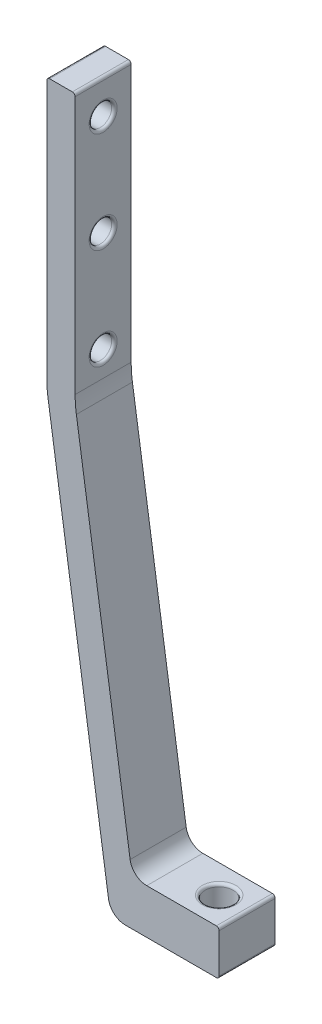
ISO-10303-21;
HEADER;
FILE_DESCRIPTION(('STEP AP214'),'2;1');
FILE_NAME('part.step','',(''),(''),'','','');
FILE_SCHEMA(('AUTOMOTIVE_DESIGN { 1 0 10303 214 1 1 1 1 }'));
ENDSEC;
DATA;
#1=APPLICATION_CONTEXT('core data for automotive mechanical design processes');
#2=APPLICATION_PROTOCOL_DEFINITION('international standard','automotive_design',2000,#1);
#3=PRODUCT_CONTEXT('',#1,'mechanical');
#4=PRODUCT('Part','Part','',(#3));
#5=PRODUCT_RELATED_PRODUCT_CATEGORY('part','',(#4));
#6=PRODUCT_DEFINITION_FORMATION('','',#4);
#7=PRODUCT_DEFINITION_CONTEXT('part definition',#1,'design');
#8=PRODUCT_DEFINITION('design','',#6,#7);
#9=PRODUCT_DEFINITION_SHAPE('','',#8);
#10=(LENGTH_UNIT() NAMED_UNIT(*) SI_UNIT(.MILLI.,.METRE.));
#11=(NAMED_UNIT(*) PLANE_ANGLE_UNIT() SI_UNIT($,.RADIAN.));
#12=(NAMED_UNIT(*) SI_UNIT($,.STERADIAN.) SOLID_ANGLE_UNIT());
#13=UNCERTAINTY_MEASURE_WITH_UNIT(LENGTH_MEASURE(1.E-05),#10,'distance_accuracy_value','');
#14=(GEOMETRIC_REPRESENTATION_CONTEXT(3) GLOBAL_UNCERTAINTY_ASSIGNED_CONTEXT((#13)) GLOBAL_UNIT_ASSIGNED_CONTEXT((#10,
#11,#12)) REPRESENTATION_CONTEXT('',''));
#15=CARTESIAN_POINT('',(0.,0.,0.));
#16=DIRECTION('',(0.,0.,1.));
#17=DIRECTION('',(1.,0.,0.));
#18=AXIS2_PLACEMENT_3D('',#15,#16,#17);
#19=CARTESIAN_POINT('',(-27.,8.,5.));
#20=DIRECTION('',(-1.,0.,0.));
#21=DIRECTION('',(0.,0.,1.));
#22=AXIS2_PLACEMENT_3D('',#19,#20,#21);
#23=PLANE('',#22);
#24=DIRECTION('',(0.,1.,0.));
#25=VECTOR('',#24,1.);
#26=CARTESIAN_POINT('',(-27.,8.,5.));
#27=LINE('',#26,#25);
#28=CARTESIAN_POINT('',(-27.,0.5,5.));
#29=VERTEX_POINT('',#28);
#30=CARTESIAN_POINT('',(-27.,7.5,5.));
#31=VERTEX_POINT('',#30);
#32=EDGE_CURVE('E171',#29,#31,#27,.T.);
#33=ORIENTED_EDGE('',*,*,#32,.F.);
#34=DIRECTION('',(0.,0.,-1.));
#35=VECTOR('',#34,1.);
#36=CARTESIAN_POINT('',(-27.,0.5,5.));
#37=LINE('',#36,#35);
#38=CARTESIAN_POINT('',(-27.,0.5,-5.));
#39=VERTEX_POINT('',#38);
#40=EDGE_CURVE('E256',#29,#39,#37,.T.);
#41=ORIENTED_EDGE('',*,*,#40,.T.);
#42=DIRECTION('',(0.,1.,0.));
#43=VECTOR('',#42,1.);
#44=CARTESIAN_POINT('',(-27.,8.,-5.));
#45=LINE('',#44,#43);
#46=CARTESIAN_POINT('',(-27.,7.5,-5.));
#47=VERTEX_POINT('',#46);
#48=EDGE_CURVE('E321',#39,#47,#45,.T.);
#49=ORIENTED_EDGE('',*,*,#48,.T.);
#50=DIRECTION('',(0.,0.,-1.));
#51=VECTOR('',#50,1.);
#52=CARTESIAN_POINT('',(-27.,7.5,5.));
#53=LINE('',#52,#51);
#54=EDGE_CURVE('E254',#47,#31,#53,.F.);
#55=ORIENTED_EDGE('',*,*,#54,.T.);
#56=EDGE_LOOP('',(#33,#41,#49,#55));
#57=FACE_BOUND('',#56,.T.);
#58=ADVANCED_FACE('F34',(#57),#23,.F.);
#59=CARTESIAN_POINT('',(-42.5,8.,5.));
#60=DIRECTION('',(0.,-1.,0.));
#61=DIRECTION('',(0.,0.,-1.));
#62=AXIS2_PLACEMENT_3D('',#59,#60,#61);
#63=PLANE('',#62);
#64=CARTESIAN_POINT('',(-32.,8.,0.));
#65=DIRECTION('',(0.,-1.,0.));
#66=DIRECTION('',(0.,0.,-1.));
#67=AXIS2_PLACEMENT_3D('',#64,#65,#66);
#68=CIRCLE('',#67,3.);
#69=CARTESIAN_POINT('',(-32.,8.,-3.));
#70=VERTEX_POINT('',#69);
#71=EDGE_CURVE('E251',#70,#70,#68,.T.);
#72=ORIENTED_EDGE('',*,*,#71,.T.);
#73=EDGE_LOOP('',(#72));
#74=FACE_BOUND('',#73,.T.);
#75=DIRECTION('',(-1.,0.,0.));
#76=VECTOR('',#75,1.);
#77=CARTESIAN_POINT('',(-42.5,8.,5.));
#78=LINE('',#77,#76);
#79=CARTESIAN_POINT('',(-27.5,8.,5.));
#80=VERTEX_POINT('',#79);
#81=CARTESIAN_POINT('',(-39.9162170569194,8.,5.));
#82=VERTEX_POINT('',#81);
#83=EDGE_CURVE('E175',#80,#82,#78,.T.);
#84=ORIENTED_EDGE('',*,*,#83,.F.);
#85=DIRECTION('',(0.,0.,-1.));
#86=VECTOR('',#85,1.);
#87=CARTESIAN_POINT('',(-27.5,8.,5.));
#88=LINE('',#87,#86);
#89=CARTESIAN_POINT('',(-27.5,8.,-5.));
#90=VERTEX_POINT('',#89);
#91=EDGE_CURVE('E248',#80,#90,#88,.T.);
#92=ORIENTED_EDGE('',*,*,#91,.T.);
#93=DIRECTION('',(-1.,0.,0.));
#94=VECTOR('',#93,1.);
#95=CARTESIAN_POINT('',(-42.5,8.,-5.));
#96=LINE('',#95,#94);
#97=CARTESIAN_POINT('',(-39.9162170569194,8.,-5.));
#98=VERTEX_POINT('',#97);
#99=EDGE_CURVE('E300',#90,#98,#96,.T.);
#100=ORIENTED_EDGE('',*,*,#99,.T.);
#101=DIRECTION('',(0.,0.,-1.));
#102=VECTOR('',#101,1.);
#103=CARTESIAN_POINT('',(-39.9162170569194,8.,5.));
#104=LINE('',#103,#102);
#105=EDGE_CURVE('E187',#98,#82,#104,.F.);
#106=ORIENTED_EDGE('',*,*,#105,.T.);
#107=EDGE_LOOP('',(#84,#92,#100,#106));
#108=FACE_BOUND('',#107,.T.);
#109=ADVANCED_FACE('F357',(#74,#108),#63,.F.);
#110=CARTESIAN_POINT('',(-52.6941269376831,76.,5.));
#111=DIRECTION('',(-0.988948879525204,-0.148256917834696,0.));
#112=DIRECTION('',(0.148256917834696,-0.988948879525204,0.));
#113=AXIS2_PLACEMENT_3D('',#110,#111,#112);
#114=PLANE('',#113);
#115=DIRECTION('',(-0.148256917834696,0.988948879525204,0.));
#116=VECTOR('',#115,1.);
#117=CARTESIAN_POINT('',(-52.6941269376831,76.,-5.));
#118=LINE('',#117,#116);
#119=CARTESIAN_POINT('',(-42.883063695495,10.5552292464959,-5.));
#120=VERTEX_POINT('',#119);
#121=CARTESIAN_POINT('',(-52.4731045281871,74.5256683639905,-5.));
#122=VERTEX_POINT('',#121);
#123=EDGE_CURVE('E294',#120,#122,#118,.T.);
#124=ORIENTED_EDGE('',*,*,#123,.T.);
#125=DIRECTION('',(0.,0.,-1.));
#126=VECTOR('',#125,1.);
#127=CARTESIAN_POINT('',(-52.4731045281871,74.5256683639905,5.));
#128=LINE('',#127,#126);
#129=CARTESIAN_POINT('',(-52.4731045281871,74.5256683639905,5.));
#130=VERTEX_POINT('',#129);
#131=EDGE_CURVE('E55',#122,#130,#128,.F.);
#132=ORIENTED_EDGE('',*,*,#131,.T.);
#133=DIRECTION('',(-0.148256917834696,0.988948879525204,0.));
#134=VECTOR('',#133,1.);
#135=CARTESIAN_POINT('',(-52.6941269376831,76.,5.));
#136=LINE('',#135,#134);
#137=CARTESIAN_POINT('',(-42.883063695495,10.5552292464959,5.));
#138=VERTEX_POINT('',#137);
#139=EDGE_CURVE('E308',#138,#130,#136,.T.);
#140=ORIENTED_EDGE('',*,*,#139,.F.);
#141=DIRECTION('',(0.,0.,-1.));
#142=VECTOR('',#141,1.);
#143=CARTESIAN_POINT('',(-42.883063695495,10.5552292464959,-5.));
#144=LINE('',#143,#142);
#145=EDGE_CURVE('E184',#138,#120,#144,.T.);
#146=ORIENTED_EDGE('',*,*,#145,.T.);
#147=EDGE_LOOP('',(#124,#132,#140,#146));
#148=FACE_BOUND('',#147,.T.);
#149=ADVANCED_FACE('F298',(#148),#114,.F.);
#150=CARTESIAN_POINT('',(-52.6941269376831,76.,5.));
#151=DIRECTION('',(-1.,0.,0.));
#152=DIRECTION('',(0.,0.,1.));
#153=AXIS2_PLACEMENT_3D('',#150,#151,#152);
#154=PLANE('',#153);
#155=CARTESIAN_POINT('',(-52.6941269376831,118.,0.));
#156=DIRECTION('',(-1.,0.,0.));
#157=DIRECTION('',(0.,0.,1.));
#158=AXIS2_PLACEMENT_3D('',#155,#156,#157);
#159=CIRCLE('',#158,2.5);
#160=CARTESIAN_POINT('',(-52.6941269376831,118.,2.5));
#161=VERTEX_POINT('',#160);
#162=EDGE_CURVE('E222',#161,#161,#159,.T.);
#163=ORIENTED_EDGE('',*,*,#162,.T.);
#164=EDGE_LOOP('',(#163));
#165=FACE_BOUND('',#164,.T.);
#166=CARTESIAN_POINT('',(-52.6941269376831,82.,0.));
#167=DIRECTION('',(-1.,0.,0.));
#168=DIRECTION('',(0.,0.,1.));
#169=AXIS2_PLACEMENT_3D('',#166,#167,#168);
#170=CIRCLE('',#169,2.5);
#171=CARTESIAN_POINT('',(-52.6941269376831,82.,2.5));
#172=VERTEX_POINT('',#171);
#173=EDGE_CURVE('E219',#172,#172,#170,.T.);
#174=ORIENTED_EDGE('',*,*,#173,.T.);
#175=EDGE_LOOP('',(#174));
#176=FACE_BOUND('',#175,.T.);
#177=CARTESIAN_POINT('',(-52.6941269376831,100.,0.));
#178=DIRECTION('',(-1.,0.,0.));
#179=DIRECTION('',(0.,0.,1.));
#180=AXIS2_PLACEMENT_3D('',#177,#178,#179);
#181=CIRCLE('',#180,2.5);
#182=CARTESIAN_POINT('',(-52.6941269376831,100.,2.5));
#183=VERTEX_POINT('',#182);
#184=EDGE_CURVE('E216',#183,#183,#181,.T.);
#185=ORIENTED_EDGE('',*,*,#184,.T.);
#186=EDGE_LOOP('',(#185));
#187=FACE_BOUND('',#186,.T.);
#188=DIRECTION('',(0.,1.,0.));
#189=VECTOR('',#188,1.);
#190=CARTESIAN_POINT('',(-52.6941269376831,76.,5.));
#191=LINE('',#190,#189);
#192=CARTESIAN_POINT('',(-52.6941269376831,77.4908067206844,5.));
#193=VERTEX_POINT('',#192);
#194=CARTESIAN_POINT('',(-52.6941269376831,123.5,5.));
#195=VERTEX_POINT('',#194);
#196=EDGE_CURVE('E304',#193,#195,#191,.T.);
#197=ORIENTED_EDGE('',*,*,#196,.F.);
#198=DIRECTION('',(0.,0.,-1.));
#199=VECTOR('',#198,1.);
#200=CARTESIAN_POINT('',(-52.6941269376831,77.4908067206844,-5.));
#201=LINE('',#200,#199);
#202=CARTESIAN_POINT('',(-52.6941269376831,77.4908067206844,-5.));
#203=VERTEX_POINT('',#202);
#204=EDGE_CURVE('E289',#193,#203,#201,.T.);
#205=ORIENTED_EDGE('',*,*,#204,.T.);
#206=DIRECTION('',(0.,1.,0.));
#207=VECTOR('',#206,1.);
#208=CARTESIAN_POINT('',(-52.6941269376831,76.,-5.));
#209=LINE('',#208,#207);
#210=CARTESIAN_POINT('',(-52.6941269376831,123.5,-5.));
#211=VERTEX_POINT('',#210);
#212=EDGE_CURVE('E295',#203,#211,#209,.T.);
#213=ORIENTED_EDGE('',*,*,#212,.T.);
#214=DIRECTION('',(0.,0.,-1.));
#215=VECTOR('',#214,1.);
#216=CARTESIAN_POINT('',(-52.6941269376831,123.5,5.));
#217=LINE('',#216,#215);
#218=EDGE_CURVE('E213',#211,#195,#217,.F.);
#219=ORIENTED_EDGE('',*,*,#218,.T.);
#220=EDGE_LOOP('',(#197,#205,#213,#219));
#221=FACE_BOUND('',#220,.T.);
#222=ADVANCED_FACE('F303',(#165,#176,#187,#221),#154,.F.);
#223=CARTESIAN_POINT('',(-57.75,124.,5.));
#224=DIRECTION('',(0.,-1.,0.));
#225=DIRECTION('',(0.,0.,-1.));
#226=AXIS2_PLACEMENT_3D('',#223,#224,#225);
#227=PLANE('',#226);
#228=DIRECTION('',(-1.,0.,0.));
#229=VECTOR('',#228,1.);
#230=CARTESIAN_POINT('',(-57.75,124.,5.));
#231=LINE('',#230,#229);
#232=CARTESIAN_POINT('',(-53.1941269376831,124.,5.));
#233=VERTEX_POINT('',#232);
#234=CARTESIAN_POINT('',(-57.25,124.,5.));
#235=VERTEX_POINT('',#234);
#236=EDGE_CURVE('E307',#233,#235,#231,.T.);
#237=ORIENTED_EDGE('',*,*,#236,.F.);
#238=DIRECTION('',(0.,0.,-1.));
#239=VECTOR('',#238,1.);
#240=CARTESIAN_POINT('',(-53.1941269376831,124.,5.));
#241=LINE('',#240,#239);
#242=CARTESIAN_POINT('',(-53.1941269376831,124.,-5.));
#243=VERTEX_POINT('',#242);
#244=EDGE_CURVE('E277',#233,#243,#241,.T.);
#245=ORIENTED_EDGE('',*,*,#244,.T.);
#246=DIRECTION('',(-1.,0.,0.));
#247=VECTOR('',#246,1.);
#248=CARTESIAN_POINT('',(-57.75,124.,-5.));
#249=LINE('',#248,#247);
#250=CARTESIAN_POINT('',(-57.25,124.,-5.));
#251=VERTEX_POINT('',#250);
#252=EDGE_CURVE('E326',#243,#251,#249,.T.);
#253=ORIENTED_EDGE('',*,*,#252,.T.);
#254=DIRECTION('',(0.,0.,-1.));
#255=VECTOR('',#254,1.);
#256=CARTESIAN_POINT('',(-57.25,124.,5.));
#257=LINE('',#256,#255);
#258=EDGE_CURVE('E275',#251,#235,#257,.F.);
#259=ORIENTED_EDGE('',*,*,#258,.T.);
#260=EDGE_LOOP('',(#237,#245,#253,#259));
#261=FACE_BOUND('',#260,.T.);
#262=ADVANCED_FACE('F386',(#261),#227,.F.);
#263=CARTESIAN_POINT('',(-57.75,76.,5.));
#264=DIRECTION('',(1.,0.,0.));
#265=DIRECTION('',(0.,0.,-1.));
#266=AXIS2_PLACEMENT_3D('',#263,#264,#265);
#267=PLANE('',#266);
#268=CARTESIAN_POINT('',(-57.75,118.,0.));
#269=DIRECTION('',(1.,0.,0.));
#270=DIRECTION('',(0.,0.,-1.));
#271=AXIS2_PLACEMENT_3D('',#268,#269,#270);
#272=CIRCLE('',#271,2.5);
#273=CARTESIAN_POINT('',(-57.75,118.,-2.5));
#274=VERTEX_POINT('',#273);
#275=EDGE_CURVE('E210',#274,#274,#272,.T.);
#276=ORIENTED_EDGE('',*,*,#275,.T.);
#277=EDGE_LOOP('',(#276));
#278=FACE_BOUND('',#277,.T.);
#279=CARTESIAN_POINT('',(-57.75,82.,0.));
#280=DIRECTION('',(1.,0.,0.));
#281=DIRECTION('',(0.,0.,-1.));
#282=AXIS2_PLACEMENT_3D('',#279,#280,#281);
#283=CIRCLE('',#282,2.5);
#284=CARTESIAN_POINT('',(-57.75,82.,-2.5));
#285=VERTEX_POINT('',#284);
#286=EDGE_CURVE('E207',#285,#285,#283,.T.);
#287=ORIENTED_EDGE('',*,*,#286,.T.);
#288=EDGE_LOOP('',(#287));
#289=FACE_BOUND('',#288,.T.);
#290=CARTESIAN_POINT('',(-57.75,100.,0.));
#291=DIRECTION('',(1.,0.,0.));
#292=DIRECTION('',(0.,0.,-1.));
#293=AXIS2_PLACEMENT_3D('',#290,#291,#292);
#294=CIRCLE('',#293,2.5);
#295=CARTESIAN_POINT('',(-57.75,100.,-2.5));
#296=VERTEX_POINT('',#295);
#297=EDGE_CURVE('E204',#296,#296,#294,.T.);
#298=ORIENTED_EDGE('',*,*,#297,.T.);
#299=EDGE_LOOP('',(#298));
#300=FACE_BOUND('',#299,.T.);
#301=DIRECTION('',(0.,-1.,0.));
#302=VECTOR('',#301,1.);
#303=CARTESIAN_POINT('',(-57.75,76.,-5.));
#304=LINE('',#303,#302);
#305=CARTESIAN_POINT('',(-57.75,123.5,-5.));
#306=VERTEX_POINT('',#305);
#307=CARTESIAN_POINT('',(-57.75,77.4908067206844,-5.));
#308=VERTEX_POINT('',#307);
#309=EDGE_CURVE('E177',#306,#308,#304,.T.);
#310=ORIENTED_EDGE('',*,*,#309,.T.);
#311=DIRECTION('',(0.,0.,-1.));
#312=VECTOR('',#311,1.);
#313=CARTESIAN_POINT('',(-57.75,77.4908067206844,5.));
#314=LINE('',#313,#312);
#315=CARTESIAN_POINT('',(-57.75,77.4908067206844,5.));
#316=VERTEX_POINT('',#315);
#317=EDGE_CURVE('E285',#308,#316,#314,.F.);
#318=ORIENTED_EDGE('',*,*,#317,.T.);
#319=DIRECTION('',(0.,-1.,0.));
#320=VECTOR('',#319,1.);
#321=CARTESIAN_POINT('',(-57.75,76.,5.));
#322=LINE('',#321,#320);
#323=CARTESIAN_POINT('',(-57.75,123.5,5.));
#324=VERTEX_POINT('',#323);
#325=EDGE_CURVE('E311',#324,#316,#322,.T.);
#326=ORIENTED_EDGE('',*,*,#325,.F.);
#327=DIRECTION('',(0.,0.,-1.));
#328=VECTOR('',#327,1.);
#329=CARTESIAN_POINT('',(-57.75,123.5,5.));
#330=LINE('',#329,#328);
#331=EDGE_CURVE('E201',#324,#306,#330,.T.);
#332=ORIENTED_EDGE('',*,*,#331,.T.);
#333=EDGE_LOOP('',(#310,#318,#326,#332));
#334=FACE_BOUND('',#333,.T.);
#335=ADVANCED_FACE('F332',(#278,#289,#300,#334),#267,.F.);
#336=CARTESIAN_POINT('',(-46.3565640108248,0.,5.));
#337=DIRECTION('',(0.988948879525204,0.148256917834696,0.));
#338=DIRECTION('',(-0.148256917834696,0.988948879525204,0.));
#339=AXIS2_PLACEMENT_3D('',#336,#337,#338);
#340=PLANE('',#339);
#341=DIRECTION('',(0.148256917834696,-0.988948879525204,0.));
#342=VECTOR('',#341,1.);
#343=CARTESIAN_POINT('',(-46.3565640108248,0.,5.));
#344=LINE('',#343,#342);
#345=CARTESIAN_POINT('',(-57.5289775905041,74.5256683639905,5.));
#346=VERTEX_POINT('',#345);
#347=CARTESIAN_POINT('',(-46.7396277063198,2.55522924649591,5.));
#348=VERTEX_POINT('',#347);
#349=EDGE_CURVE('E318',#346,#348,#344,.T.);
#350=ORIENTED_EDGE('',*,*,#349,.F.);
#351=DIRECTION('',(0.,0.,-1.));
#352=VECTOR('',#351,1.);
#353=CARTESIAN_POINT('',(-57.5289775905041,74.5256683639905,5.));
#354=LINE('',#353,#352);
#355=CARTESIAN_POINT('',(-57.5289775905041,74.5256683639905,-5.));
#356=VERTEX_POINT('',#355);
#357=EDGE_CURVE('E280',#346,#356,#354,.T.);
#358=ORIENTED_EDGE('',*,*,#357,.T.);
#359=DIRECTION('',(0.148256917834696,-0.988948879525204,0.));
#360=VECTOR('',#359,1.);
#361=CARTESIAN_POINT('',(-46.3565640108248,0.,-5.));
#362=LINE('',#361,#360);
#363=CARTESIAN_POINT('',(-46.7396277063198,2.55522924649591,-5.));
#364=VERTEX_POINT('',#363);
#365=EDGE_CURVE('E172',#356,#364,#362,.T.);
#366=ORIENTED_EDGE('',*,*,#365,.T.);
#367=DIRECTION('',(0.,0.,-1.));
#368=VECTOR('',#367,1.);
#369=CARTESIAN_POINT('',(-46.7396277063198,2.55522924649591,5.));
#370=LINE('',#369,#368);
#371=EDGE_CURVE('E154',#364,#348,#370,.F.);
#372=ORIENTED_EDGE('',*,*,#371,.T.);
#373=EDGE_LOOP('',(#350,#358,#366,#372));
#374=FACE_BOUND('',#373,.T.);
#375=ADVANCED_FACE('F342',(#374),#340,.F.);
#376=CARTESIAN_POINT('',(-27.,0.,5.));
#377=DIRECTION('',(0.,1.,0.));
#378=DIRECTION('',(-1.,0.,0.));
#379=AXIS2_PLACEMENT_3D('',#376,#377,#378);
#380=PLANE('',#379);
#381=CARTESIAN_POINT('',(-32.,0.,0.));
#382=DIRECTION('',(0.,1.,0.));
#383=DIRECTION('',(-1.,0.,0.));
#384=AXIS2_PLACEMENT_3D('',#381,#382,#383);
#385=CIRCLE('',#384,3.);
#386=CARTESIAN_POINT('',(-35.,0.,0.));
#387=VERTEX_POINT('',#386);
#388=EDGE_CURVE('E239',#387,#387,#385,.T.);
#389=ORIENTED_EDGE('',*,*,#388,.T.);
#390=EDGE_LOOP('',(#389));
#391=FACE_BOUND('',#390,.T.);
#392=DIRECTION('',(1.,0.,0.));
#393=VECTOR('',#392,1.);
#394=CARTESIAN_POINT('',(-27.,0.,-5.));
#395=LINE('',#394,#393);
#396=CARTESIAN_POINT('',(-43.7727810677442,0.,-5.));
#397=VERTEX_POINT('',#396);
#398=CARTESIAN_POINT('',(-27.5,0.,-5.));
#399=VERTEX_POINT('',#398);
#400=EDGE_CURVE('E163',#397,#399,#395,.T.);
#401=ORIENTED_EDGE('',*,*,#400,.T.);
#402=DIRECTION('',(0.,0.,-1.));
#403=VECTOR('',#402,1.);
#404=CARTESIAN_POINT('',(-27.5,0.,5.));
#405=LINE('',#404,#403);
#406=CARTESIAN_POINT('',(-27.5,0.,5.));
#407=VERTEX_POINT('',#406);
#408=EDGE_CURVE('E237',#399,#407,#405,.F.);
#409=ORIENTED_EDGE('',*,*,#408,.T.);
#410=DIRECTION('',(1.,0.,0.));
#411=VECTOR('',#410,1.);
#412=CARTESIAN_POINT('',(-27.,0.,5.));
#413=LINE('',#412,#411);
#414=CARTESIAN_POINT('',(-43.7727810677442,0.,5.));
#415=VERTEX_POINT('',#414);
#416=EDGE_CURVE('E166',#415,#407,#413,.T.);
#417=ORIENTED_EDGE('',*,*,#416,.F.);
#418=DIRECTION('',(0.,0.,-1.));
#419=VECTOR('',#418,1.);
#420=CARTESIAN_POINT('',(-43.7727810677442,0.,5.));
#421=LINE('',#420,#419);
#422=EDGE_CURVE('E152',#415,#397,#421,.T.);
#423=ORIENTED_EDGE('',*,*,#422,.T.);
#424=EDGE_LOOP('',(#401,#409,#417,#423));
#425=FACE_BOUND('',#424,.T.);
#426=ADVANCED_FACE('F162',(#391,#425),#380,.F.);
#427=CARTESIAN_POINT('',(0.,0.,5.));
#428=DIRECTION('',(0.,0.,-1.));
#429=DIRECTION('',(-1.,0.,0.));
#430=AXIS2_PLACEMENT_3D('',#427,#428,#429);
#431=PLANE('',#430);
#432=ORIENTED_EDGE('',*,*,#325,.T.);
#433=CARTESIAN_POINT('',(-37.75,77.4908067206844,5.));
#434=DIRECTION('',(0.,0.,-1.));
#435=DIRECTION('',(-1.,0.,0.));
#436=AXIS2_PLACEMENT_3D('',#433,#434,#435);
#437=CIRCLE('',#436,20.);
#438=EDGE_CURVE('E287',#316,#346,#437,.F.);
#439=ORIENTED_EDGE('',*,*,#438,.T.);
#440=ORIENTED_EDGE('',*,*,#349,.T.);
#441=CARTESIAN_POINT('',(-43.7727810677442,3.,5.));
#442=DIRECTION('',(0.,0.,-1.));
#443=DIRECTION('',(-1.,0.,0.));
#444=AXIS2_PLACEMENT_3D('',#441,#442,#443);
#445=CIRCLE('',#444,3.);
#446=EDGE_CURVE('E182',#348,#415,#445,.F.);
#447=ORIENTED_EDGE('',*,*,#446,.T.);
#448=ORIENTED_EDGE('',*,*,#416,.T.);
#449=CARTESIAN_POINT('',(-27.5,0.5,5.));
#450=DIRECTION('',(0.,0.,-1.));
#451=DIRECTION('',(-1.,0.,0.));
#452=AXIS2_PLACEMENT_3D('',#449,#450,#451);
#453=CIRCLE('',#452,0.5);
#454=EDGE_CURVE('E273',#407,#29,#453,.F.);
#455=ORIENTED_EDGE('',*,*,#454,.T.);
#456=ORIENTED_EDGE('',*,*,#32,.T.);
#457=CARTESIAN_POINT('',(-27.5,7.5,5.));
#458=DIRECTION('',(0.,0.,-1.));
#459=DIRECTION('',(-1.,0.,0.));
#460=AXIS2_PLACEMENT_3D('',#457,#458,#459);
#461=CIRCLE('',#460,0.5);
#462=EDGE_CURVE('E271',#31,#80,#461,.F.);
#463=ORIENTED_EDGE('',*,*,#462,.T.);
#464=ORIENTED_EDGE('',*,*,#83,.T.);
#465=CARTESIAN_POINT('',(-39.9162170569194,11.,5.));
#466=DIRECTION('',(0.,0.,-1.));
#467=DIRECTION('',(-1.,0.,0.));
#468=AXIS2_PLACEMENT_3D('',#465,#466,#467);
#469=CIRCLE('',#468,3.);
#470=EDGE_CURVE('E193',#82,#138,#469,.T.);
#471=ORIENTED_EDGE('',*,*,#470,.T.);
#472=ORIENTED_EDGE('',*,*,#139,.T.);
#473=CARTESIAN_POINT('',(-32.6941269376831,77.4908067206844,5.));
#474=DIRECTION('',(0.,0.,-1.));
#475=DIRECTION('',(-1.,0.,0.));
#476=AXIS2_PLACEMENT_3D('',#473,#474,#475);
#477=CIRCLE('',#476,20.);
#478=EDGE_CURVE('E11',#130,#193,#477,.T.);
#479=ORIENTED_EDGE('',*,*,#478,.T.);
#480=ORIENTED_EDGE('',*,*,#196,.T.);
#481=CARTESIAN_POINT('',(-53.1941269376831,123.5,5.));
#482=DIRECTION('',(0.,0.,-1.));
#483=DIRECTION('',(-1.,0.,0.));
#484=AXIS2_PLACEMENT_3D('',#481,#482,#483);
#485=CIRCLE('',#484,0.5);
#486=EDGE_CURVE('E269',#195,#233,#485,.F.);
#487=ORIENTED_EDGE('',*,*,#486,.T.);
#488=ORIENTED_EDGE('',*,*,#236,.T.);
#489=CARTESIAN_POINT('',(-57.25,123.5,5.));
#490=DIRECTION('',(0.,0.,-1.));
#491=DIRECTION('',(-1.,0.,0.));
#492=AXIS2_PLACEMENT_3D('',#489,#490,#491);
#493=CIRCLE('',#492,0.5);
#494=EDGE_CURVE('E267',#235,#324,#493,.F.);
#495=ORIENTED_EDGE('',*,*,#494,.T.);
#496=EDGE_LOOP('',(#432,#439,#440,#447,#448,#455,#456,#463,#464,#471,#472,#479,#480,#487,#488,#495));
#497=FACE_BOUND('',#496,.T.);
#498=ADVANCED_FACE('F340',(#497),#431,.F.);
#499=CARTESIAN_POINT('',(0.,0.,-5.));
#500=DIRECTION('',(0.,0.,-1.));
#501=DIRECTION('',(-1.,0.,0.));
#502=AXIS2_PLACEMENT_3D('',#499,#500,#501);
#503=PLANE('',#502);
#504=ORIENTED_EDGE('',*,*,#365,.F.);
#505=CARTESIAN_POINT('',(-37.75,77.4908067206844,-5.));
#506=DIRECTION('',(0.,0.,-1.));
#507=DIRECTION('',(-1.,0.,0.));
#508=AXIS2_PLACEMENT_3D('',#505,#506,#507);
#509=CIRCLE('',#508,20.);
#510=EDGE_CURVE('E283',#356,#308,#509,.T.);
#511=ORIENTED_EDGE('',*,*,#510,.T.);
#512=ORIENTED_EDGE('',*,*,#309,.F.);
#513=CARTESIAN_POINT('',(-57.25,123.5,-5.));
#514=DIRECTION('',(0.,0.,-1.));
#515=DIRECTION('',(-1.,0.,0.));
#516=AXIS2_PLACEMENT_3D('',#513,#514,#515);
#517=CIRCLE('',#516,0.5);
#518=EDGE_CURVE('E259',#306,#251,#517,.T.);
#519=ORIENTED_EDGE('',*,*,#518,.T.);
#520=ORIENTED_EDGE('',*,*,#252,.F.);
#521=CARTESIAN_POINT('',(-53.1941269376831,123.5,-5.));
#522=DIRECTION('',(0.,0.,-1.));
#523=DIRECTION('',(-1.,0.,0.));
#524=AXIS2_PLACEMENT_3D('',#521,#522,#523);
#525=CIRCLE('',#524,0.5);
#526=EDGE_CURVE('E261',#243,#211,#525,.T.);
#527=ORIENTED_EDGE('',*,*,#526,.T.);
#528=ORIENTED_EDGE('',*,*,#212,.F.);
#529=CARTESIAN_POINT('',(-32.6941269376831,77.4908067206844,-5.));
#530=DIRECTION('',(0.,0.,-1.));
#531=DIRECTION('',(-1.,0.,0.));
#532=AXIS2_PLACEMENT_3D('',#529,#530,#531);
#533=CIRCLE('',#532,20.);
#534=EDGE_CURVE('E42',#203,#122,#533,.F.);
#535=ORIENTED_EDGE('',*,*,#534,.T.);
#536=ORIENTED_EDGE('',*,*,#123,.F.);
#537=CARTESIAN_POINT('',(-39.9162170569194,11.,-5.));
#538=DIRECTION('',(0.,0.,-1.));
#539=DIRECTION('',(-1.,0.,0.));
#540=AXIS2_PLACEMENT_3D('',#537,#538,#539);
#541=CIRCLE('',#540,3.);
#542=EDGE_CURVE('E190',#120,#98,#541,.F.);
#543=ORIENTED_EDGE('',*,*,#542,.T.);
#544=ORIENTED_EDGE('',*,*,#99,.F.);
#545=CARTESIAN_POINT('',(-27.5,7.5,-5.));
#546=DIRECTION('',(0.,0.,-1.));
#547=DIRECTION('',(-1.,0.,0.));
#548=AXIS2_PLACEMENT_3D('',#545,#546,#547);
#549=CIRCLE('',#548,0.5);
#550=EDGE_CURVE('E264',#90,#47,#549,.T.);
#551=ORIENTED_EDGE('',*,*,#550,.T.);
#552=ORIENTED_EDGE('',*,*,#48,.F.);
#553=CARTESIAN_POINT('',(-27.5,0.5,-5.));
#554=DIRECTION('',(0.,0.,-1.));
#555=DIRECTION('',(-1.,0.,0.));
#556=AXIS2_PLACEMENT_3D('',#553,#554,#555);
#557=CIRCLE('',#556,0.5);
#558=EDGE_CURVE('E170',#39,#399,#557,.T.);
#559=ORIENTED_EDGE('',*,*,#558,.T.);
#560=ORIENTED_EDGE('',*,*,#400,.F.);
#561=CARTESIAN_POINT('',(-43.7727810677442,3.,-5.));
#562=DIRECTION('',(0.,0.,-1.));
#563=DIRECTION('',(-1.,0.,0.));
#564=AXIS2_PLACEMENT_3D('',#561,#562,#563);
#565=CIRCLE('',#564,3.);
#566=EDGE_CURVE('E148',#397,#364,#565,.T.);
#567=ORIENTED_EDGE('',*,*,#566,.T.);
#568=EDGE_LOOP('',(#504,#511,#512,#519,#520,#527,#528,#535,#536,#543,#544,#551,#552,#559,#560,#567));
#569=FACE_BOUND('',#568,.T.);
#570=ADVANCED_FACE('F168',(#569),#503,.T.);
#571=CARTESIAN_POINT('',(-32.,-2.,0.));
#572=DIRECTION('',(0.,1.,0.));
#573=DIRECTION('',(0.,0.,1.));
#574=AXIS2_PLACEMENT_3D('',#571,#572,#573);
#575=CYLINDRICAL_SURFACE('',#574,2.5);
#576=CARTESIAN_POINT('',(-32.,0.499999999999998,0.));
#577=DIRECTION('',(0.,1.,0.));
#578=DIRECTION('',(-1.,0.,0.));
#579=AXIS2_PLACEMENT_3D('',#576,#577,#578);
#580=CIRCLE('',#579,2.5);
#581=CARTESIAN_POINT('',(-34.5,0.499999999999998,0.));
#582=VERTEX_POINT('',#581);
#583=EDGE_CURVE('E245',#582,#582,#580,.F.);
#584=ORIENTED_EDGE('',*,*,#583,.T.);
#585=EDGE_LOOP('',(#584));
#586=FACE_BOUND('',#585,.T.);
#587=CARTESIAN_POINT('',(-32.,7.5,0.));
#588=DIRECTION('',(0.,-1.,0.));
#589=DIRECTION('',(0.,0.,-1.));
#590=AXIS2_PLACEMENT_3D('',#587,#588,#589);
#591=CIRCLE('',#590,2.5);
#592=CARTESIAN_POINT('',(-32.,7.5,-2.5));
#593=VERTEX_POINT('',#592);
#594=EDGE_CURVE('E242',#593,#593,#591,.F.);
#595=ORIENTED_EDGE('',*,*,#594,.T.);
#596=EDGE_LOOP('',(#595));
#597=FACE_BOUND('',#596,.T.);
#598=ADVANCED_FACE('F401',(#586,#597),#575,.F.);
#599=CARTESIAN_POINT('',(-57.751,100.,0.));
#600=DIRECTION('',(1.,0.,0.));
#601=DIRECTION('',(0.,0.,-1.));
#602=AXIS2_PLACEMENT_3D('',#599,#600,#601);
#603=CYLINDRICAL_SURFACE('',#602,2.);
#604=CARTESIAN_POINT('',(-57.25,100.,0.));
#605=DIRECTION('',(1.,0.,0.));
#606=DIRECTION('',(0.,0.,-1.));
#607=AXIS2_PLACEMENT_3D('',#604,#605,#606);
#608=CIRCLE('',#607,2.);
#609=CARTESIAN_POINT('',(-57.25,100.,-2.));
#610=VERTEX_POINT('',#609);
#611=EDGE_CURVE('E234',#610,#610,#608,.F.);
#612=ORIENTED_EDGE('',*,*,#611,.T.);
#613=EDGE_LOOP('',(#612));
#614=FACE_BOUND('',#613,.T.);
#615=CARTESIAN_POINT('',(-53.1941269376831,100.,0.));
#616=DIRECTION('',(-1.,0.,0.));
#617=DIRECTION('',(0.,0.,1.));
#618=AXIS2_PLACEMENT_3D('',#615,#616,#617);
#619=CIRCLE('',#618,2.);
#620=CARTESIAN_POINT('',(-53.1941269376831,100.,2.));
#621=VERTEX_POINT('',#620);
#622=EDGE_CURVE('E231',#621,#621,#619,.F.);
#623=ORIENTED_EDGE('',*,*,#622,.T.);
#624=EDGE_LOOP('',(#623));
#625=FACE_BOUND('',#624,.T.);
#626=ADVANCED_FACE('F406',(#614,#625),#603,.F.);
#627=CARTESIAN_POINT('',(-57.751,118.,0.));
#628=DIRECTION('',(1.,0.,0.));
#629=DIRECTION('',(0.,0.,-1.));
#630=AXIS2_PLACEMENT_3D('',#627,#628,#629);
#631=CYLINDRICAL_SURFACE('',#630,2.);
#632=CARTESIAN_POINT('',(-57.25,118.,0.));
#633=DIRECTION('',(1.,0.,0.));
#634=DIRECTION('',(0.,0.,-1.));
#635=AXIS2_PLACEMENT_3D('',#632,#633,#634);
#636=CIRCLE('',#635,2.);
#637=CARTESIAN_POINT('',(-57.25,118.,-2.));
#638=VERTEX_POINT('',#637);
#639=EDGE_CURVE('E198',#638,#638,#636,.F.);
#640=ORIENTED_EDGE('',*,*,#639,.T.);
#641=EDGE_LOOP('',(#640));
#642=FACE_BOUND('',#641,.T.);
#643=CARTESIAN_POINT('',(-53.1941269376831,118.,0.));
#644=DIRECTION('',(-1.,0.,0.));
#645=DIRECTION('',(0.,0.,1.));
#646=AXIS2_PLACEMENT_3D('',#643,#644,#645);
#647=CIRCLE('',#646,2.);
#648=CARTESIAN_POINT('',(-53.1941269376831,118.,2.));
#649=VERTEX_POINT('',#648);
#650=EDGE_CURVE('E195',#649,#649,#647,.F.);
#651=ORIENTED_EDGE('',*,*,#650,.T.);
#652=EDGE_LOOP('',(#651));
#653=FACE_BOUND('',#652,.T.);
#654=ADVANCED_FACE('F410',(#642,#653),#631,.F.);
#655=CARTESIAN_POINT('',(-57.751,82.,0.));
#656=DIRECTION('',(1.,0.,0.));
#657=DIRECTION('',(0.,0.,-1.));
#658=AXIS2_PLACEMENT_3D('',#655,#656,#657);
#659=CYLINDRICAL_SURFACE('',#658,2.);
#660=CARTESIAN_POINT('',(-57.25,82.,0.));
#661=DIRECTION('',(1.,0.,0.));
#662=DIRECTION('',(0.,0.,-1.));
#663=AXIS2_PLACEMENT_3D('',#660,#661,#662);
#664=CIRCLE('',#663,2.);
#665=CARTESIAN_POINT('',(-57.25,82.,-2.));
#666=VERTEX_POINT('',#665);
#667=EDGE_CURVE('E228',#666,#666,#664,.F.);
#668=ORIENTED_EDGE('',*,*,#667,.T.);
#669=EDGE_LOOP('',(#668));
#670=FACE_BOUND('',#669,.T.);
#671=CARTESIAN_POINT('',(-53.1941269376831,82.,0.));
#672=DIRECTION('',(-1.,0.,0.));
#673=DIRECTION('',(0.,0.,1.));
#674=AXIS2_PLACEMENT_3D('',#671,#672,#673);
#675=CIRCLE('',#674,2.);
#676=CARTESIAN_POINT('',(-53.1941269376831,82.,2.));
#677=VERTEX_POINT('',#676);
#678=EDGE_CURVE('E225',#677,#677,#675,.F.);
#679=ORIENTED_EDGE('',*,*,#678,.T.);
#680=EDGE_LOOP('',(#679));
#681=FACE_BOUND('',#680,.T.);
#682=ADVANCED_FACE('F372',(#670,#681),#659,.F.);
#683=CARTESIAN_POINT('',(-43.7727810677442,3.,5.));
#684=DIRECTION('',(0.,0.,-1.));
#685=DIRECTION('',(-1.,0.,0.));
#686=AXIS2_PLACEMENT_3D('',#683,#684,#685);
#687=CYLINDRICAL_SURFACE('',#686,3.);
#688=ORIENTED_EDGE('',*,*,#446,.F.);
#689=ORIENTED_EDGE('',*,*,#371,.F.);
#690=ORIENTED_EDGE('',*,*,#566,.F.);
#691=ORIENTED_EDGE('',*,*,#422,.F.);
#692=EDGE_LOOP('',(#688,#689,#690,#691));
#693=FACE_BOUND('',#692,.T.);
#694=ADVANCED_FACE('F151',(#693),#687,.T.);
#695=CARTESIAN_POINT('',(-39.9162170569194,11.,5.));
#696=DIRECTION('',(0.,0.,1.));
#697=DIRECTION('',(1.,0.,0.));
#698=AXIS2_PLACEMENT_3D('',#695,#696,#697);
#699=CYLINDRICAL_SURFACE('',#698,3.);
#700=ORIENTED_EDGE('',*,*,#470,.F.);
#701=ORIENTED_EDGE('',*,*,#105,.F.);
#702=ORIENTED_EDGE('',*,*,#542,.F.);
#703=ORIENTED_EDGE('',*,*,#145,.F.);
#704=EDGE_LOOP('',(#700,#701,#702,#703));
#705=FACE_BOUND('',#704,.T.);
#706=ADVANCED_FACE('F361',(#705),#699,.F.);
#707=CARTESIAN_POINT('',(-57.25,118.,0.));
#708=DIRECTION('',(1.,0.,0.));
#709=DIRECTION('',(0.,0.,-1.));
#710=AXIS2_PLACEMENT_3D('',#707,#708,#709);
#711=TOROIDAL_SURFACE('',#710,2.5,0.5);
#712=ORIENTED_EDGE('',*,*,#275,.F.);
#713=EDGE_LOOP('',(#712));
#714=FACE_BOUND('',#713,.T.);
#715=ORIENTED_EDGE('',*,*,#639,.F.);
#716=EDGE_LOOP('',(#715));
#717=FACE_BOUND('',#716,.T.);
#718=ADVANCED_FACE('F363',(#714,#717),#711,.T.);
#719=CARTESIAN_POINT('',(-53.1941269376831,118.,0.));
#720=DIRECTION('',(-1.,0.,0.));
#721=DIRECTION('',(0.,0.,1.));
#722=AXIS2_PLACEMENT_3D('',#719,#720,#721);
#723=TOROIDAL_SURFACE('',#722,2.5,0.5);
#724=ORIENTED_EDGE('',*,*,#162,.F.);
#725=EDGE_LOOP('',(#724));
#726=FACE_BOUND('',#725,.T.);
#727=ORIENTED_EDGE('',*,*,#650,.F.);
#728=EDGE_LOOP('',(#727));
#729=FACE_BOUND('',#728,.T.);
#730=ADVANCED_FACE('F369',(#726,#729),#723,.T.);
#731=CARTESIAN_POINT('',(-57.25,82.,0.));
#732=DIRECTION('',(1.,0.,0.));
#733=DIRECTION('',(0.,0.,-1.));
#734=AXIS2_PLACEMENT_3D('',#731,#732,#733);
#735=TOROIDAL_SURFACE('',#734,2.5,0.5);
#736=ORIENTED_EDGE('',*,*,#286,.F.);
#737=EDGE_LOOP('',(#736));
#738=FACE_BOUND('',#737,.T.);
#739=ORIENTED_EDGE('',*,*,#667,.F.);
#740=EDGE_LOOP('',(#739));
#741=FACE_BOUND('',#740,.T.);
#742=ADVANCED_FACE('F424',(#738,#741),#735,.T.);
#743=CARTESIAN_POINT('',(-53.1941269376831,82.,0.));
#744=DIRECTION('',(-1.,0.,0.));
#745=DIRECTION('',(0.,0.,1.));
#746=AXIS2_PLACEMENT_3D('',#743,#744,#745);
#747=TOROIDAL_SURFACE('',#746,2.5,0.5);
#748=ORIENTED_EDGE('',*,*,#173,.F.);
#749=EDGE_LOOP('',(#748));
#750=FACE_BOUND('',#749,.T.);
#751=ORIENTED_EDGE('',*,*,#678,.F.);
#752=EDGE_LOOP('',(#751));
#753=FACE_BOUND('',#752,.T.);
#754=ADVANCED_FACE('F430',(#750,#753),#747,.T.);
#755=CARTESIAN_POINT('',(-57.25,100.,0.));
#756=DIRECTION('',(1.,0.,0.));
#757=DIRECTION('',(0.,0.,-1.));
#758=AXIS2_PLACEMENT_3D('',#755,#756,#757);
#759=TOROIDAL_SURFACE('',#758,2.5,0.5);
#760=ORIENTED_EDGE('',*,*,#297,.F.);
#761=EDGE_LOOP('',(#760));
#762=FACE_BOUND('',#761,.T.);
#763=ORIENTED_EDGE('',*,*,#611,.F.);
#764=EDGE_LOOP('',(#763));
#765=FACE_BOUND('',#764,.T.);
#766=ADVANCED_FACE('F437',(#762,#765),#759,.T.);
#767=CARTESIAN_POINT('',(-53.1941269376831,100.,0.));
#768=DIRECTION('',(-1.,0.,0.));
#769=DIRECTION('',(0.,0.,1.));
#770=AXIS2_PLACEMENT_3D('',#767,#768,#769);
#771=TOROIDAL_SURFACE('',#770,2.5,0.5);
#772=ORIENTED_EDGE('',*,*,#184,.F.);
#773=EDGE_LOOP('',(#772));
#774=FACE_BOUND('',#773,.T.);
#775=ORIENTED_EDGE('',*,*,#622,.F.);
#776=EDGE_LOOP('',(#775));
#777=FACE_BOUND('',#776,.T.);
#778=ADVANCED_FACE('F441',(#774,#777),#771,.T.);
#779=CARTESIAN_POINT('',(-32.,0.499999999999999,0.));
#780=DIRECTION('',(0.,1.,0.));
#781=DIRECTION('',(-1.,0.,0.));
#782=AXIS2_PLACEMENT_3D('',#779,#780,#781);
#783=TOROIDAL_SURFACE('',#782,3.,0.5);
#784=ORIENTED_EDGE('',*,*,#583,.F.);
#785=EDGE_LOOP('',(#784));
#786=FACE_BOUND('',#785,.T.);
#787=ORIENTED_EDGE('',*,*,#388,.F.);
#788=EDGE_LOOP('',(#787));
#789=FACE_BOUND('',#788,.T.);
#790=ADVANCED_FACE('F445',(#786,#789),#783,.T.);
#791=CARTESIAN_POINT('',(-32.,7.5,0.));
#792=DIRECTION('',(0.,-1.,0.));
#793=DIRECTION('',(0.,0.,-1.));
#794=AXIS2_PLACEMENT_3D('',#791,#792,#793);
#795=TOROIDAL_SURFACE('',#794,3.,0.5);
#796=ORIENTED_EDGE('',*,*,#71,.F.);
#797=EDGE_LOOP('',(#796));
#798=FACE_BOUND('',#797,.T.);
#799=ORIENTED_EDGE('',*,*,#594,.F.);
#800=EDGE_LOOP('',(#799));
#801=FACE_BOUND('',#800,.T.);
#802=ADVANCED_FACE('F449',(#798,#801),#795,.T.);
#803=CARTESIAN_POINT('',(-27.5,0.5,5.));
#804=DIRECTION('',(0.,0.,-1.));
#805=DIRECTION('',(-1.,0.,0.));
#806=AXIS2_PLACEMENT_3D('',#803,#804,#805);
#807=CYLINDRICAL_SURFACE('',#806,0.5);
#808=ORIENTED_EDGE('',*,*,#454,.F.);
#809=ORIENTED_EDGE('',*,*,#408,.F.);
#810=ORIENTED_EDGE('',*,*,#558,.F.);
#811=ORIENTED_EDGE('',*,*,#40,.F.);
#812=EDGE_LOOP('',(#808,#809,#810,#811));
#813=FACE_BOUND('',#812,.T.);
#814=ADVANCED_FACE('F347',(#813),#807,.T.);
#815=CARTESIAN_POINT('',(-27.5,7.5,5.));
#816=DIRECTION('',(0.,0.,-1.));
#817=DIRECTION('',(-1.,0.,0.));
#818=AXIS2_PLACEMENT_3D('',#815,#816,#817);
#819=CYLINDRICAL_SURFACE('',#818,0.5);
#820=ORIENTED_EDGE('',*,*,#462,.F.);
#821=ORIENTED_EDGE('',*,*,#54,.F.);
#822=ORIENTED_EDGE('',*,*,#550,.F.);
#823=ORIENTED_EDGE('',*,*,#91,.F.);
#824=EDGE_LOOP('',(#820,#821,#822,#823));
#825=FACE_BOUND('',#824,.T.);
#826=ADVANCED_FACE('F354',(#825),#819,.T.);
#827=CARTESIAN_POINT('',(-53.1941269376831,123.5,5.));
#828=DIRECTION('',(0.,0.,-1.));
#829=DIRECTION('',(-1.,0.,0.));
#830=AXIS2_PLACEMENT_3D('',#827,#828,#829);
#831=CYLINDRICAL_SURFACE('',#830,0.5);
#832=ORIENTED_EDGE('',*,*,#486,.F.);
#833=ORIENTED_EDGE('',*,*,#218,.F.);
#834=ORIENTED_EDGE('',*,*,#526,.F.);
#835=ORIENTED_EDGE('',*,*,#244,.F.);
#836=EDGE_LOOP('',(#832,#833,#834,#835));
#837=FACE_BOUND('',#836,.T.);
#838=ADVANCED_FACE('F458',(#837),#831,.T.);
#839=CARTESIAN_POINT('',(-57.25,123.5,5.));
#840=DIRECTION('',(0.,0.,-1.));
#841=DIRECTION('',(-1.,0.,0.));
#842=AXIS2_PLACEMENT_3D('',#839,#840,#841);
#843=CYLINDRICAL_SURFACE('',#842,0.5);
#844=ORIENTED_EDGE('',*,*,#494,.F.);
#845=ORIENTED_EDGE('',*,*,#258,.F.);
#846=ORIENTED_EDGE('',*,*,#518,.F.);
#847=ORIENTED_EDGE('',*,*,#331,.F.);
#848=EDGE_LOOP('',(#844,#845,#846,#847));
#849=FACE_BOUND('',#848,.T.);
#850=ADVANCED_FACE('F461',(#849),#843,.T.);
#851=CARTESIAN_POINT('',(-37.75,77.4908067206844,5.));
#852=DIRECTION('',(0.,0.,-1.));
#853=DIRECTION('',(-1.,0.,0.));
#854=AXIS2_PLACEMENT_3D('',#851,#852,#853);
#855=CYLINDRICAL_SURFACE('',#854,20.);
#856=ORIENTED_EDGE('',*,*,#438,.F.);
#857=ORIENTED_EDGE('',*,*,#317,.F.);
#858=ORIENTED_EDGE('',*,*,#510,.F.);
#859=ORIENTED_EDGE('',*,*,#357,.F.);
#860=EDGE_LOOP('',(#856,#857,#858,#859));
#861=FACE_BOUND('',#860,.T.);
#862=ADVANCED_FACE('F337',(#861),#855,.T.);
#863=CARTESIAN_POINT('',(-32.6941269376831,77.4908067206844,5.));
#864=DIRECTION('',(0.,0.,1.));
#865=DIRECTION('',(1.,0.,0.));
#866=AXIS2_PLACEMENT_3D('',#863,#864,#865);
#867=CYLINDRICAL_SURFACE('',#866,20.);
#868=ORIENTED_EDGE('',*,*,#478,.F.);
#869=ORIENTED_EDGE('',*,*,#131,.F.);
#870=ORIENTED_EDGE('',*,*,#534,.F.);
#871=ORIENTED_EDGE('',*,*,#204,.F.);
#872=EDGE_LOOP('',(#868,#869,#870,#871));
#873=FACE_BOUND('',#872,.T.);
#874=ADVANCED_FACE('F36',(#873),#867,.F.);
#875=CLOSED_SHELL('',(#58,#109,#149,#222,#262,#335,#375,#426,#498,#570,#598,#626,#654,#682,#694,
#706,#718,#730,#742,#754,#766,#778,#790,#802,#814,#826,#838,#850,#862,#874));
#876=MANIFOLD_SOLID_BREP('B2',#875);
#877=ADVANCED_BREP_SHAPE_REPRESENTATION('',(#18,#876),#14);
#878=SHAPE_DEFINITION_REPRESENTATION(#9,#877);
ENDSEC;
END-ISO-10303-21;
